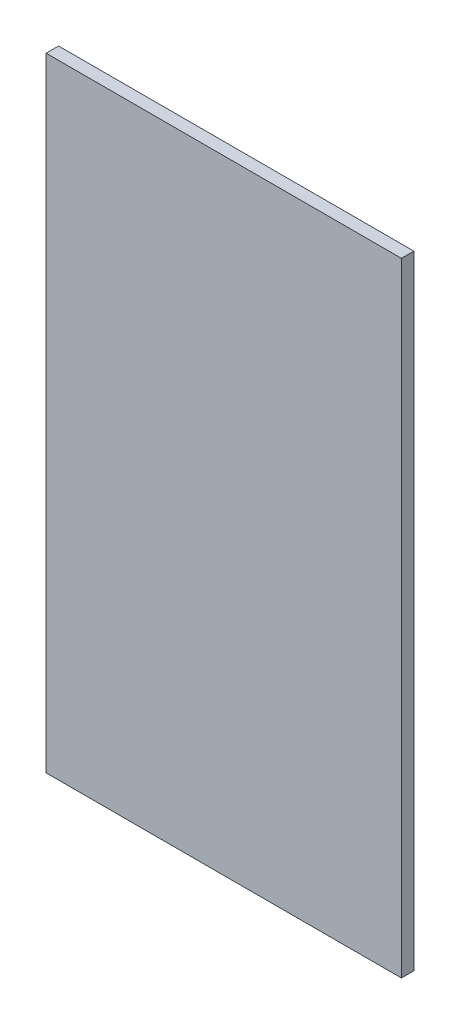
ISO-10303-21;
HEADER;
FILE_DESCRIPTION(('STEP AP214'),'2;1');
FILE_NAME('part.step','',(''),(''),'','','');
FILE_SCHEMA(('AUTOMOTIVE_DESIGN { 1 0 10303 214 1 1 1 1 }'));
ENDSEC;
DATA;
#1=APPLICATION_CONTEXT('core data for automotive mechanical design processes');
#2=APPLICATION_PROTOCOL_DEFINITION('international standard','automotive_design',2000,#1);
#3=PRODUCT_CONTEXT('',#1,'mechanical');
#4=PRODUCT('Part','Part','',(#3));
#5=PRODUCT_RELATED_PRODUCT_CATEGORY('part','',(#4));
#6=PRODUCT_DEFINITION_FORMATION('','',#4);
#7=PRODUCT_DEFINITION_CONTEXT('part definition',#1,'design');
#8=PRODUCT_DEFINITION('design','',#6,#7);
#9=PRODUCT_DEFINITION_SHAPE('','',#8);
#10=(LENGTH_UNIT() NAMED_UNIT(*) SI_UNIT(.MILLI.,.METRE.));
#11=(NAMED_UNIT(*) PLANE_ANGLE_UNIT() SI_UNIT($,.RADIAN.));
#12=(NAMED_UNIT(*) SI_UNIT($,.STERADIAN.) SOLID_ANGLE_UNIT());
#13=UNCERTAINTY_MEASURE_WITH_UNIT(LENGTH_MEASURE(1.E-05),#10,'distance_accuracy_value','');
#14=(GEOMETRIC_REPRESENTATION_CONTEXT(3) GLOBAL_UNCERTAINTY_ASSIGNED_CONTEXT((#13)) GLOBAL_UNIT_ASSIGNED_CONTEXT((#10,
#11,#12)) REPRESENTATION_CONTEXT('',''));
#15=CARTESIAN_POINT('',(0.,0.,0.));
#16=DIRECTION('',(0.,0.,1.));
#17=DIRECTION('',(1.,0.,0.));
#18=AXIS2_PLACEMENT_3D('',#15,#16,#17);
#19=CARTESIAN_POINT('',(-1.425,-2.5,0.1));
#20=DIRECTION('',(0.,0.,-1.));
#21=DIRECTION('',(-1.,0.,0.));
#22=AXIS2_PLACEMENT_3D('',#19,#20,#21);
#23=PLANE('',#22);
#24=DIRECTION('',(0.,1.,0.));
#25=VECTOR('',#24,1.);
#26=CARTESIAN_POINT('',(1.425,-2.5,0.1));
#27=LINE('',#26,#25);
#28=CARTESIAN_POINT('',(1.425,-2.5,0.1));
#29=VERTEX_POINT('',#28);
#30=CARTESIAN_POINT('',(1.425,2.5,0.1));
#31=VERTEX_POINT('',#30);
#32=EDGE_CURVE('E55',#29,#31,#27,.T.);
#33=ORIENTED_EDGE('',*,*,#32,.T.);
#34=DIRECTION('',(1.,0.,0.));
#35=VECTOR('',#34,1.);
#36=CARTESIAN_POINT('',(1.425,2.5,0.1));
#37=LINE('',#36,#35);
#38=CARTESIAN_POINT('',(-1.425,2.5,0.1));
#39=VERTEX_POINT('',#38);
#40=EDGE_CURVE('E57',#31,#39,#37,.F.);
#41=ORIENTED_EDGE('',*,*,#40,.T.);
#42=DIRECTION('',(0.,1.,0.));
#43=VECTOR('',#42,1.);
#44=CARTESIAN_POINT('',(-1.425,2.5,0.1));
#45=LINE('',#44,#43);
#46=CARTESIAN_POINT('',(-1.425,-2.5,0.1));
#47=VERTEX_POINT('',#46);
#48=EDGE_CURVE('E20',#39,#47,#45,.F.);
#49=ORIENTED_EDGE('',*,*,#48,.T.);
#50=DIRECTION('',(1.,0.,0.));
#51=VECTOR('',#50,1.);
#52=CARTESIAN_POINT('',(-1.425,-2.5,0.1));
#53=LINE('',#52,#51);
#54=EDGE_CURVE('E80',#47,#29,#53,.T.);
#55=ORIENTED_EDGE('',*,*,#54,.T.);
#56=EDGE_LOOP('',(#33,#41,#49,#55));
#57=FACE_BOUND('',#56,.T.);
#58=ADVANCED_FACE('F17',(#57),#23,.F.);
#59=CARTESIAN_POINT('',(-1.425,2.5,0.));
#60=DIRECTION('',(1.,0.,0.));
#61=DIRECTION('',(0.,0.,-1.));
#62=AXIS2_PLACEMENT_3D('',#59,#60,#61);
#63=PLANE('',#62);
#64=DIRECTION('',(0.,0.,1.));
#65=VECTOR('',#64,1.);
#66=CARTESIAN_POINT('',(-1.425,-2.5,0.));
#67=LINE('',#66,#65);
#68=CARTESIAN_POINT('',(-1.425,-2.5,0.));
#69=VERTEX_POINT('',#68);
#70=EDGE_CURVE('E68',#69,#47,#67,.T.);
#71=ORIENTED_EDGE('',*,*,#70,.T.);
#72=ORIENTED_EDGE('',*,*,#48,.F.);
#73=DIRECTION('',(0.,0.,-1.));
#74=VECTOR('',#73,1.);
#75=CARTESIAN_POINT('',(-1.425,2.5,0.));
#76=LINE('',#75,#74);
#77=CARTESIAN_POINT('',(-1.425,2.5,0.));
#78=VERTEX_POINT('',#77);
#79=EDGE_CURVE('E63',#39,#78,#76,.T.);
#80=ORIENTED_EDGE('',*,*,#79,.T.);
#81=DIRECTION('',(0.,1.,0.));
#82=VECTOR('',#81,1.);
#83=CARTESIAN_POINT('',(-1.425,-2.5,0.));
#84=LINE('',#83,#82);
#85=EDGE_CURVE('E83',#69,#78,#84,.T.);
#86=ORIENTED_EDGE('',*,*,#85,.F.);
#87=EDGE_LOOP('',(#71,#72,#80,#86));
#88=FACE_BOUND('',#87,.T.);
#89=ADVANCED_FACE('F65',(#88),#63,.F.);
#90=CARTESIAN_POINT('',(1.425,2.5,0.));
#91=DIRECTION('',(0.,-1.,0.));
#92=DIRECTION('',(0.,0.,-1.));
#93=AXIS2_PLACEMENT_3D('',#90,#91,#92);
#94=PLANE('',#93);
#95=ORIENTED_EDGE('',*,*,#79,.F.);
#96=ORIENTED_EDGE('',*,*,#40,.F.);
#97=DIRECTION('',(0.,0.,1.));
#98=VECTOR('',#97,1.);
#99=CARTESIAN_POINT('',(1.425,2.5,0.));
#100=LINE('',#99,#98);
#101=CARTESIAN_POINT('',(1.425,2.5,0.));
#102=VERTEX_POINT('',#101);
#103=EDGE_CURVE('E75',#31,#102,#100,.F.);
#104=ORIENTED_EDGE('',*,*,#103,.T.);
#105=DIRECTION('',(-1.,0.,0.));
#106=VECTOR('',#105,1.);
#107=CARTESIAN_POINT('',(-1.425,2.5,0.));
#108=LINE('',#107,#106);
#109=EDGE_CURVE('E72',#78,#102,#108,.F.);
#110=ORIENTED_EDGE('',*,*,#109,.F.);
#111=EDGE_LOOP('',(#95,#96,#104,#110));
#112=FACE_BOUND('',#111,.T.);
#113=ADVANCED_FACE('F70',(#112),#94,.F.);
#114=CARTESIAN_POINT('',(1.425,-2.5,0.));
#115=DIRECTION('',(-1.,0.,0.));
#116=DIRECTION('',(0.,0.,1.));
#117=AXIS2_PLACEMENT_3D('',#114,#115,#116);
#118=PLANE('',#117);
#119=ORIENTED_EDGE('',*,*,#103,.F.);
#120=ORIENTED_EDGE('',*,*,#32,.F.);
#121=DIRECTION('',(0.,0.,1.));
#122=VECTOR('',#121,1.);
#123=CARTESIAN_POINT('',(1.425,-2.5,0.));
#124=LINE('',#123,#122);
#125=CARTESIAN_POINT('',(1.425,-2.5,0.));
#126=VERTEX_POINT('',#125);
#127=EDGE_CURVE('E35',#29,#126,#124,.F.);
#128=ORIENTED_EDGE('',*,*,#127,.T.);
#129=DIRECTION('',(0.,1.,0.));
#130=VECTOR('',#129,1.);
#131=CARTESIAN_POINT('',(1.425,-2.5,0.));
#132=LINE('',#131,#130);
#133=EDGE_CURVE('E26',#102,#126,#132,.F.);
#134=ORIENTED_EDGE('',*,*,#133,.F.);
#135=EDGE_LOOP('',(#119,#120,#128,#134));
#136=FACE_BOUND('',#135,.T.);
#137=ADVANCED_FACE('F89',(#136),#118,.F.);
#138=CARTESIAN_POINT('',(-1.425,-2.5,0.));
#139=DIRECTION('',(0.,1.,0.));
#140=DIRECTION('',(0.,0.,1.));
#141=AXIS2_PLACEMENT_3D('',#138,#139,#140);
#142=PLANE('',#141);
#143=ORIENTED_EDGE('',*,*,#127,.F.);
#144=ORIENTED_EDGE('',*,*,#54,.F.);
#145=ORIENTED_EDGE('',*,*,#70,.F.);
#146=DIRECTION('',(-1.,0.,0.));
#147=VECTOR('',#146,1.);
#148=CARTESIAN_POINT('',(-1.425,-2.5,0.));
#149=LINE('',#148,#147);
#150=EDGE_CURVE('E11',#126,#69,#149,.T.);
#151=ORIENTED_EDGE('',*,*,#150,.F.);
#152=EDGE_LOOP('',(#143,#144,#145,#151));
#153=FACE_BOUND('',#152,.T.);
#154=ADVANCED_FACE('F91',(#153),#142,.F.);
#155=CARTESIAN_POINT('',(-1.425,-2.5,0.));
#156=DIRECTION('',(0.,0.,-1.));
#157=DIRECTION('',(-1.,0.,0.));
#158=AXIS2_PLACEMENT_3D('',#155,#156,#157);
#159=PLANE('',#158);
#160=ORIENTED_EDGE('',*,*,#133,.T.);
#161=ORIENTED_EDGE('',*,*,#150,.T.);
#162=ORIENTED_EDGE('',*,*,#85,.T.);
#163=ORIENTED_EDGE('',*,*,#109,.T.);
#164=EDGE_LOOP('',(#160,#161,#162,#163));
#165=FACE_BOUND('',#164,.T.);
#166=ADVANCED_FACE('F88',(#165),#159,.T.);
#167=CLOSED_SHELL('',(#58,#89,#113,#137,#154,#166));
#168=MANIFOLD_SOLID_BREP('B1',#167);
#169=ADVANCED_BREP_SHAPE_REPRESENTATION('',(#18,#168),#14);
#170=SHAPE_DEFINITION_REPRESENTATION(#9,#169);
ENDSEC;
END-ISO-10303-21;
